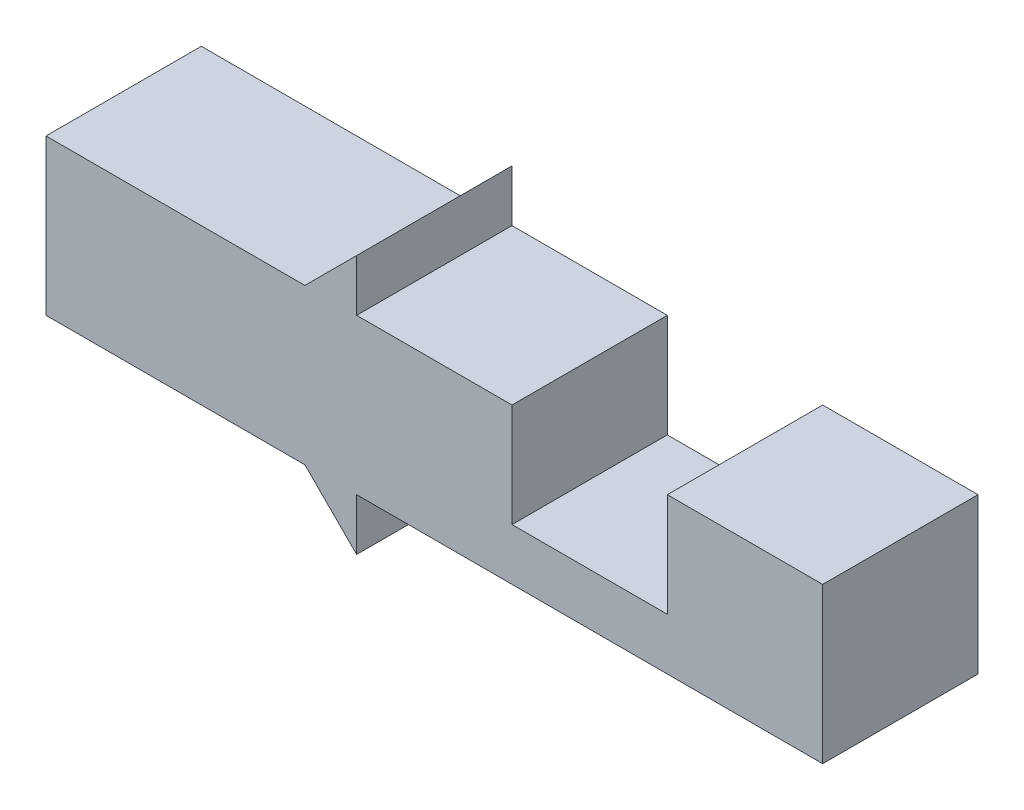
ISO-10303-21;
HEADER;
FILE_DESCRIPTION(('STEP AP214'),'2;1');
FILE_NAME('part.step','',(''),(''),'','','');
FILE_SCHEMA(('AUTOMOTIVE_DESIGN { 1 0 10303 214 1 1 1 1 }'));
ENDSEC;
DATA;
#1=APPLICATION_CONTEXT('core data for automotive mechanical design processes');
#2=APPLICATION_PROTOCOL_DEFINITION('international standard','automotive_design',2000,#1);
#3=PRODUCT_CONTEXT('',#1,'mechanical');
#4=PRODUCT('Part','Part','',(#3));
#5=PRODUCT_RELATED_PRODUCT_CATEGORY('part','',(#4));
#6=PRODUCT_DEFINITION_FORMATION('','',#4);
#7=PRODUCT_DEFINITION_CONTEXT('part definition',#1,'design');
#8=PRODUCT_DEFINITION('design','',#6,#7);
#9=PRODUCT_DEFINITION_SHAPE('','',#8);
#10=(LENGTH_UNIT() NAMED_UNIT(*) SI_UNIT(.MILLI.,.METRE.));
#11=(NAMED_UNIT(*) PLANE_ANGLE_UNIT() SI_UNIT($,.RADIAN.));
#12=(NAMED_UNIT(*) SI_UNIT($,.STERADIAN.) SOLID_ANGLE_UNIT());
#13=UNCERTAINTY_MEASURE_WITH_UNIT(LENGTH_MEASURE(1.E-05),#10,'distance_accuracy_value','');
#14=(GEOMETRIC_REPRESENTATION_CONTEXT(3) GLOBAL_UNCERTAINTY_ASSIGNED_CONTEXT((#13)) GLOBAL_UNIT_ASSIGNED_CONTEXT((#10,
#11,#12)) REPRESENTATION_CONTEXT('',''));
#15=CARTESIAN_POINT('',(0.,0.,0.));
#16=DIRECTION('',(0.,0.,1.));
#17=DIRECTION('',(1.,0.,0.));
#18=AXIS2_PLACEMENT_3D('',#15,#16,#17);
#19=CARTESIAN_POINT('',(0.,6.,6.));
#20=DIRECTION('',(-1.,0.,0.));
#21=DIRECTION('',(0.,-1.,0.));
#22=AXIS2_PLACEMENT_3D('',#19,#20,#21);
#23=PLANE('',#22);
#24=DIRECTION('',(0.,1.,0.));
#25=VECTOR('',#24,1.);
#26=CARTESIAN_POINT('',(0.,6.,0.));
#27=LINE('',#26,#25);
#28=CARTESIAN_POINT('',(0.,0.,0.));
#29=VERTEX_POINT('',#28);
#30=CARTESIAN_POINT('',(0.,6.,0.));
#31=VERTEX_POINT('',#30);
#32=EDGE_CURVE('E176',#29,#31,#27,.T.);
#33=ORIENTED_EDGE('',*,*,#32,.T.);
#34=DIRECTION('',(0.,0.,-1.));
#35=VECTOR('',#34,1.);
#36=CARTESIAN_POINT('',(0.,6.,6.));
#37=LINE('',#36,#35);
#38=CARTESIAN_POINT('',(0.,6.,6.));
#39=VERTEX_POINT('',#38);
#40=EDGE_CURVE('E11',#39,#31,#37,.T.);
#41=ORIENTED_EDGE('',*,*,#40,.F.);
#42=DIRECTION('',(0.,1.,0.));
#43=VECTOR('',#42,1.);
#44=CARTESIAN_POINT('',(0.,6.,6.));
#45=LINE('',#44,#43);
#46=CARTESIAN_POINT('',(0.,0.,6.));
#47=VERTEX_POINT('',#46);
#48=EDGE_CURVE('E216',#47,#39,#45,.T.);
#49=ORIENTED_EDGE('',*,*,#48,.F.);
#50=DIRECTION('',(0.,0.,-1.));
#51=VECTOR('',#50,1.);
#52=CARTESIAN_POINT('',(0.,0.,6.));
#53=LINE('',#52,#51);
#54=EDGE_CURVE('E172',#47,#29,#53,.T.);
#55=ORIENTED_EDGE('',*,*,#54,.T.);
#56=EDGE_LOOP('',(#33,#41,#49,#55));
#57=FACE_BOUND('',#56,.T.);
#58=ADVANCED_FACE('F39',(#57),#23,.F.);
#59=CARTESIAN_POINT('',(-6.,6.,6.));
#60=DIRECTION('',(0.,-1.,0.));
#61=DIRECTION('',(0.,0.,-1.));
#62=AXIS2_PLACEMENT_3D('',#59,#60,#61);
#63=PLANE('',#62);
#64=DIRECTION('',(-1.,0.,0.));
#65=VECTOR('',#64,1.);
#66=CARTESIAN_POINT('',(-6.,6.,0.));
#67=LINE('',#66,#65);
#68=CARTESIAN_POINT('',(-6.,6.,0.));
#69=VERTEX_POINT('',#68);
#70=EDGE_CURVE('E180',#31,#69,#67,.T.);
#71=ORIENTED_EDGE('',*,*,#70,.T.);
#72=DIRECTION('',(0.,0.,-1.));
#73=VECTOR('',#72,1.);
#74=CARTESIAN_POINT('',(-6.,6.,6.));
#75=LINE('',#74,#73);
#76=CARTESIAN_POINT('',(-6.,6.,6.));
#77=VERTEX_POINT('',#76);
#78=EDGE_CURVE('E48',#77,#69,#75,.T.);
#79=ORIENTED_EDGE('',*,*,#78,.F.);
#80=DIRECTION('',(-1.,0.,0.));
#81=VECTOR('',#80,1.);
#82=CARTESIAN_POINT('',(-6.,6.,6.));
#83=LINE('',#82,#81);
#84=EDGE_CURVE('E117',#39,#77,#83,.T.);
#85=ORIENTED_EDGE('',*,*,#84,.F.);
#86=ORIENTED_EDGE('',*,*,#40,.T.);
#87=EDGE_LOOP('',(#71,#79,#85,#86));
#88=FACE_BOUND('',#87,.T.);
#89=ADVANCED_FACE('F324',(#88),#63,.F.);
#90=CARTESIAN_POINT('',(-5.99999999999999,2.,6.));
#91=DIRECTION('',(1.,0.,0.));
#92=DIRECTION('',(0.,1.,0.));
#93=AXIS2_PLACEMENT_3D('',#90,#91,#92);
#94=PLANE('',#93);
#95=DIRECTION('',(0.,-1.,0.));
#96=VECTOR('',#95,1.);
#97=CARTESIAN_POINT('',(-5.99999999999999,2.,0.));
#98=LINE('',#97,#96);
#99=CARTESIAN_POINT('',(-5.99999999999999,2.,0.));
#100=VERTEX_POINT('',#99);
#101=EDGE_CURVE('E183',#69,#100,#98,.T.);
#102=ORIENTED_EDGE('',*,*,#101,.T.);
#103=DIRECTION('',(0.,0.,-1.));
#104=VECTOR('',#103,1.);
#105=CARTESIAN_POINT('',(-5.99999999999999,2.,6.));
#106=LINE('',#105,#104);
#107=CARTESIAN_POINT('',(-5.99999999999999,2.,6.));
#108=VERTEX_POINT('',#107);
#109=EDGE_CURVE('E251',#108,#100,#106,.T.);
#110=ORIENTED_EDGE('',*,*,#109,.F.);
#111=DIRECTION('',(0.,-1.,0.));
#112=VECTOR('',#111,1.);
#113=CARTESIAN_POINT('',(-5.99999999999999,2.,6.));
#114=LINE('',#113,#112);
#115=EDGE_CURVE('E261',#77,#108,#114,.T.);
#116=ORIENTED_EDGE('',*,*,#115,.F.);
#117=ORIENTED_EDGE('',*,*,#78,.T.);
#118=EDGE_LOOP('',(#102,#110,#116,#117));
#119=FACE_BOUND('',#118,.T.);
#120=ADVANCED_FACE('F259',(#119),#94,.F.);
#121=CARTESIAN_POINT('',(-12.,2.,6.));
#122=DIRECTION('',(0.,-1.,0.));
#123=DIRECTION('',(0.,0.,-1.));
#124=AXIS2_PLACEMENT_3D('',#121,#122,#123);
#125=PLANE('',#124);
#126=DIRECTION('',(-1.,0.,0.));
#127=VECTOR('',#126,1.);
#128=CARTESIAN_POINT('',(-12.,2.,0.));
#129=LINE('',#128,#127);
#130=CARTESIAN_POINT('',(-12.,2.,0.));
#131=VERTEX_POINT('',#130);
#132=EDGE_CURVE('E186',#100,#131,#129,.T.);
#133=ORIENTED_EDGE('',*,*,#132,.T.);
#134=DIRECTION('',(0.,0.,-1.));
#135=VECTOR('',#134,1.);
#136=CARTESIAN_POINT('',(-12.,2.,6.));
#137=LINE('',#136,#135);
#138=CARTESIAN_POINT('',(-12.,2.,6.));
#139=VERTEX_POINT('',#138);
#140=EDGE_CURVE('E247',#139,#131,#137,.T.);
#141=ORIENTED_EDGE('',*,*,#140,.F.);
#142=DIRECTION('',(-1.,0.,0.));
#143=VECTOR('',#142,1.);
#144=CARTESIAN_POINT('',(-12.,2.,6.));
#145=LINE('',#144,#143);
#146=EDGE_CURVE('E280',#108,#139,#145,.T.);
#147=ORIENTED_EDGE('',*,*,#146,.F.);
#148=ORIENTED_EDGE('',*,*,#109,.T.);
#149=EDGE_LOOP('',(#133,#141,#147,#148));
#150=FACE_BOUND('',#149,.T.);
#151=ADVANCED_FACE('F270',(#150),#125,.F.);
#152=CARTESIAN_POINT('',(-12.,6.,6.));
#153=DIRECTION('',(-1.,0.,0.));
#154=DIRECTION('',(0.,0.,1.));
#155=AXIS2_PLACEMENT_3D('',#152,#153,#154);
#156=PLANE('',#155);
#157=DIRECTION('',(0.,1.,0.));
#158=VECTOR('',#157,1.);
#159=CARTESIAN_POINT('',(-12.,6.,0.));
#160=LINE('',#159,#158);
#161=CARTESIAN_POINT('',(-12.,6.,0.));
#162=VERTEX_POINT('',#161);
#163=EDGE_CURVE('E189',#131,#162,#160,.T.);
#164=ORIENTED_EDGE('',*,*,#163,.T.);
#165=DIRECTION('',(0.,0.,-1.));
#166=VECTOR('',#165,1.);
#167=CARTESIAN_POINT('',(-12.,6.,6.));
#168=LINE('',#167,#166);
#169=CARTESIAN_POINT('',(-12.,6.,6.));
#170=VERTEX_POINT('',#169);
#171=EDGE_CURVE('E243',#170,#162,#168,.T.);
#172=ORIENTED_EDGE('',*,*,#171,.F.);
#173=DIRECTION('',(0.,1.,0.));
#174=VECTOR('',#173,1.);
#175=CARTESIAN_POINT('',(-12.,6.,6.));
#176=LINE('',#175,#174);
#177=EDGE_CURVE('E276',#139,#170,#176,.T.);
#178=ORIENTED_EDGE('',*,*,#177,.F.);
#179=ORIENTED_EDGE('',*,*,#140,.T.);
#180=EDGE_LOOP('',(#164,#172,#178,#179));
#181=FACE_BOUND('',#180,.T.);
#182=ADVANCED_FACE('F274',(#181),#156,.F.);
#183=CARTESIAN_POINT('',(-18.,6.,6.));
#184=DIRECTION('',(0.,-1.,0.));
#185=DIRECTION('',(1.,0.,0.));
#186=AXIS2_PLACEMENT_3D('',#183,#184,#185);
#187=PLANE('',#186);
#188=DIRECTION('',(-1.,0.,0.));
#189=VECTOR('',#188,1.);
#190=CARTESIAN_POINT('',(-18.,6.,0.));
#191=LINE('',#190,#189);
#192=CARTESIAN_POINT('',(-18.,6.,0.));
#193=VERTEX_POINT('',#192);
#194=EDGE_CURVE('E192',#162,#193,#191,.T.);
#195=ORIENTED_EDGE('',*,*,#194,.T.);
#196=DIRECTION('',(0.,0.,-1.));
#197=VECTOR('',#196,1.);
#198=CARTESIAN_POINT('',(-18.,6.,6.));
#199=LINE('',#198,#197);
#200=CARTESIAN_POINT('',(-18.,6.,6.));
#201=VERTEX_POINT('',#200);
#202=EDGE_CURVE('E239',#201,#193,#199,.T.);
#203=ORIENTED_EDGE('',*,*,#202,.F.);
#204=DIRECTION('',(-1.,0.,0.));
#205=VECTOR('',#204,1.);
#206=CARTESIAN_POINT('',(-18.,6.,6.));
#207=LINE('',#206,#205);
#208=EDGE_CURVE('E279',#170,#201,#207,.T.);
#209=ORIENTED_EDGE('',*,*,#208,.F.);
#210=ORIENTED_EDGE('',*,*,#171,.T.);
#211=EDGE_LOOP('',(#195,#203,#209,#210));
#212=FACE_BOUND('',#211,.T.);
#213=ADVANCED_FACE('F337',(#212),#187,.F.);
#214=CARTESIAN_POINT('',(-18.,8.,6.));
#215=DIRECTION('',(-1.,0.,0.));
#216=DIRECTION('',(0.,0.,1.));
#217=AXIS2_PLACEMENT_3D('',#214,#215,#216);
#218=PLANE('',#217);
#219=DIRECTION('',(0.,1.,0.));
#220=VECTOR('',#219,1.);
#221=CARTESIAN_POINT('',(-18.,8.,0.));
#222=LINE('',#221,#220);
#223=CARTESIAN_POINT('',(-18.,8.,0.));
#224=VERTEX_POINT('',#223);
#225=EDGE_CURVE('E195',#193,#224,#222,.T.);
#226=ORIENTED_EDGE('',*,*,#225,.T.);
#227=DIRECTION('',(0.,0.,-1.));
#228=VECTOR('',#227,1.);
#229=CARTESIAN_POINT('',(-18.,8.,6.));
#230=LINE('',#229,#228);
#231=CARTESIAN_POINT('',(-18.,8.,6.));
#232=VERTEX_POINT('',#231);
#233=EDGE_CURVE('E235',#232,#224,#230,.T.);
#234=ORIENTED_EDGE('',*,*,#233,.F.);
#235=DIRECTION('',(0.,1.,0.));
#236=VECTOR('',#235,1.);
#237=CARTESIAN_POINT('',(-18.,8.,6.));
#238=LINE('',#237,#236);
#239=EDGE_CURVE('E284',#201,#232,#238,.T.);
#240=ORIENTED_EDGE('',*,*,#239,.F.);
#241=ORIENTED_EDGE('',*,*,#202,.T.);
#242=EDGE_LOOP('',(#226,#234,#240,#241));
#243=FACE_BOUND('',#242,.T.);
#244=ADVANCED_FACE('F340',(#243),#218,.F.);
#245=CARTESIAN_POINT('',(-20.,6.,6.));
#246=DIRECTION('',(0.707106781186547,-0.707106781186548,0.));
#247=DIRECTION('',(0.707106781186548,0.707106781186547,0.));
#248=AXIS2_PLACEMENT_3D('',#245,#246,#247);
#249=PLANE('',#248);
#250=DIRECTION('',(-0.707106781186548,-0.707106781186547,0.));
#251=VECTOR('',#250,1.);
#252=CARTESIAN_POINT('',(-20.,6.,0.));
#253=LINE('',#252,#251);
#254=CARTESIAN_POINT('',(-20.,6.,0.));
#255=VERTEX_POINT('',#254);
#256=EDGE_CURVE('E198',#224,#255,#253,.T.);
#257=ORIENTED_EDGE('',*,*,#256,.T.);
#258=DIRECTION('',(0.,0.,-1.));
#259=VECTOR('',#258,1.);
#260=CARTESIAN_POINT('',(-20.,6.,6.));
#261=LINE('',#260,#259);
#262=CARTESIAN_POINT('',(-20.,6.,6.));
#263=VERTEX_POINT('',#262);
#264=EDGE_CURVE('E231',#263,#255,#261,.T.);
#265=ORIENTED_EDGE('',*,*,#264,.F.);
#266=DIRECTION('',(-0.707106781186548,-0.707106781186547,0.));
#267=VECTOR('',#266,1.);
#268=CARTESIAN_POINT('',(-20.,6.,6.));
#269=LINE('',#268,#267);
#270=EDGE_CURVE('E291',#232,#263,#269,.T.);
#271=ORIENTED_EDGE('',*,*,#270,.F.);
#272=ORIENTED_EDGE('',*,*,#233,.T.);
#273=EDGE_LOOP('',(#257,#265,#271,#272));
#274=FACE_BOUND('',#273,.T.);
#275=ADVANCED_FACE('F344',(#274),#249,.F.);
#276=CARTESIAN_POINT('',(-30.,6.,6.));
#277=DIRECTION('',(0.,-1.,0.));
#278=DIRECTION('',(1.,0.,0.));
#279=AXIS2_PLACEMENT_3D('',#276,#277,#278);
#280=PLANE('',#279);
#281=DIRECTION('',(-1.,0.,0.));
#282=VECTOR('',#281,1.);
#283=CARTESIAN_POINT('',(-30.,6.,0.));
#284=LINE('',#283,#282);
#285=CARTESIAN_POINT('',(-30.,6.,0.));
#286=VERTEX_POINT('',#285);
#287=EDGE_CURVE('E201',#255,#286,#284,.T.);
#288=ORIENTED_EDGE('',*,*,#287,.T.);
#289=DIRECTION('',(0.,0.,-1.));
#290=VECTOR('',#289,1.);
#291=CARTESIAN_POINT('',(-30.,6.,6.));
#292=LINE('',#291,#290);
#293=CARTESIAN_POINT('',(-30.,6.,6.));
#294=VERTEX_POINT('',#293);
#295=EDGE_CURVE('E227',#294,#286,#292,.T.);
#296=ORIENTED_EDGE('',*,*,#295,.F.);
#297=DIRECTION('',(-1.,0.,0.));
#298=VECTOR('',#297,1.);
#299=CARTESIAN_POINT('',(-30.,6.,6.));
#300=LINE('',#299,#298);
#301=EDGE_CURVE('E294',#263,#294,#300,.T.);
#302=ORIENTED_EDGE('',*,*,#301,.F.);
#303=ORIENTED_EDGE('',*,*,#264,.T.);
#304=EDGE_LOOP('',(#288,#296,#302,#303));
#305=FACE_BOUND('',#304,.T.);
#306=ADVANCED_FACE('F348',(#305),#280,.F.);
#307=CARTESIAN_POINT('',(-30.,0.,6.));
#308=DIRECTION('',(1.,0.,0.));
#309=DIRECTION('',(0.,0.,-1.));
#310=AXIS2_PLACEMENT_3D('',#307,#308,#309);
#311=PLANE('',#310);
#312=DIRECTION('',(0.,-1.,0.));
#313=VECTOR('',#312,1.);
#314=CARTESIAN_POINT('',(-30.,0.,0.));
#315=LINE('',#314,#313);
#316=CARTESIAN_POINT('',(-30.,0.,0.));
#317=VERTEX_POINT('',#316);
#318=EDGE_CURVE('E204',#286,#317,#315,.T.);
#319=ORIENTED_EDGE('',*,*,#318,.T.);
#320=DIRECTION('',(0.,0.,-1.));
#321=VECTOR('',#320,1.);
#322=CARTESIAN_POINT('',(-30.,0.,6.));
#323=LINE('',#322,#321);
#324=CARTESIAN_POINT('',(-30.,0.,6.));
#325=VERTEX_POINT('',#324);
#326=EDGE_CURVE('E223',#325,#317,#323,.T.);
#327=ORIENTED_EDGE('',*,*,#326,.F.);
#328=DIRECTION('',(0.,-1.,0.));
#329=VECTOR('',#328,1.);
#330=CARTESIAN_POINT('',(-30.,0.,6.));
#331=LINE('',#330,#329);
#332=EDGE_CURVE('E297',#294,#325,#331,.T.);
#333=ORIENTED_EDGE('',*,*,#332,.F.);
#334=ORIENTED_EDGE('',*,*,#295,.T.);
#335=EDGE_LOOP('',(#319,#327,#333,#334));
#336=FACE_BOUND('',#335,.T.);
#337=ADVANCED_FACE('F305',(#336),#311,.F.);
#338=CARTESIAN_POINT('',(-20.,0.,6.));
#339=DIRECTION('',(0.,1.,0.));
#340=DIRECTION('',(-1.,0.,0.));
#341=AXIS2_PLACEMENT_3D('',#338,#339,#340);
#342=PLANE('',#341);
#343=DIRECTION('',(1.,0.,0.));
#344=VECTOR('',#343,1.);
#345=CARTESIAN_POINT('',(-20.,0.,0.));
#346=LINE('',#345,#344);
#347=CARTESIAN_POINT('',(-20.,0.,0.));
#348=VERTEX_POINT('',#347);
#349=EDGE_CURVE('E207',#317,#348,#346,.T.);
#350=ORIENTED_EDGE('',*,*,#349,.T.);
#351=DIRECTION('',(0.,0.,-1.));
#352=VECTOR('',#351,1.);
#353=CARTESIAN_POINT('',(-20.,0.,6.));
#354=LINE('',#353,#352);
#355=CARTESIAN_POINT('',(-20.,0.,6.));
#356=VERTEX_POINT('',#355);
#357=EDGE_CURVE('E165',#356,#348,#354,.T.);
#358=ORIENTED_EDGE('',*,*,#357,.F.);
#359=DIRECTION('',(1.,0.,0.));
#360=VECTOR('',#359,1.);
#361=CARTESIAN_POINT('',(-20.,0.,6.));
#362=LINE('',#361,#360);
#363=EDGE_CURVE('E154',#325,#356,#362,.T.);
#364=ORIENTED_EDGE('',*,*,#363,.F.);
#365=ORIENTED_EDGE('',*,*,#326,.T.);
#366=EDGE_LOOP('',(#350,#358,#364,#365));
#367=FACE_BOUND('',#366,.T.);
#368=ADVANCED_FACE('F309',(#367),#342,.F.);
#369=CARTESIAN_POINT('',(-18.,-2.,6.));
#370=DIRECTION('',(0.707106781186548,0.707106781186547,0.));
#371=DIRECTION('',(-0.707106781186547,0.707106781186548,0.));
#372=AXIS2_PLACEMENT_3D('',#369,#370,#371);
#373=PLANE('',#372);
#374=DIRECTION('',(0.707106781186547,-0.707106781186548,0.));
#375=VECTOR('',#374,1.);
#376=CARTESIAN_POINT('',(-18.,-2.,0.));
#377=LINE('',#376,#375);
#378=CARTESIAN_POINT('',(-18.,-2.,0.));
#379=VERTEX_POINT('',#378);
#380=EDGE_CURVE('E163',#348,#379,#377,.T.);
#381=ORIENTED_EDGE('',*,*,#380,.T.);
#382=DIRECTION('',(0.,0.,-1.));
#383=VECTOR('',#382,1.);
#384=CARTESIAN_POINT('',(-18.,-2.,6.));
#385=LINE('',#384,#383);
#386=CARTESIAN_POINT('',(-18.,-2.,6.));
#387=VERTEX_POINT('',#386);
#388=EDGE_CURVE('E160',#387,#379,#385,.T.);
#389=ORIENTED_EDGE('',*,*,#388,.F.);
#390=DIRECTION('',(0.707106781186547,-0.707106781186548,0.));
#391=VECTOR('',#390,1.);
#392=CARTESIAN_POINT('',(-18.,-2.,6.));
#393=LINE('',#392,#391);
#394=EDGE_CURVE('E148',#356,#387,#393,.T.);
#395=ORIENTED_EDGE('',*,*,#394,.F.);
#396=ORIENTED_EDGE('',*,*,#357,.T.);
#397=EDGE_LOOP('',(#381,#389,#395,#396));
#398=FACE_BOUND('',#397,.T.);
#399=ADVANCED_FACE('F161',(#398),#373,.F.);
#400=CARTESIAN_POINT('',(-18.,0.,6.));
#401=DIRECTION('',(-1.,0.,0.));
#402=DIRECTION('',(0.,0.,1.));
#403=AXIS2_PLACEMENT_3D('',#400,#401,#402);
#404=PLANE('',#403);
#405=DIRECTION('',(0.,1.,0.));
#406=VECTOR('',#405,1.);
#407=CARTESIAN_POINT('',(-18.,0.,0.));
#408=LINE('',#407,#406);
#409=CARTESIAN_POINT('',(-18.,0.,0.));
#410=VERTEX_POINT('',#409);
#411=EDGE_CURVE('E103',#379,#410,#408,.T.);
#412=ORIENTED_EDGE('',*,*,#411,.T.);
#413=DIRECTION('',(0.,0.,-1.));
#414=VECTOR('',#413,1.);
#415=CARTESIAN_POINT('',(-18.,0.,6.));
#416=LINE('',#415,#414);
#417=CARTESIAN_POINT('',(-18.,0.,6.));
#418=VERTEX_POINT('',#417);
#419=EDGE_CURVE('E166',#418,#410,#416,.T.);
#420=ORIENTED_EDGE('',*,*,#419,.F.);
#421=DIRECTION('',(0.,1.,0.));
#422=VECTOR('',#421,1.);
#423=CARTESIAN_POINT('',(-18.,0.,6.));
#424=LINE('',#423,#422);
#425=EDGE_CURVE('E152',#387,#418,#424,.T.);
#426=ORIENTED_EDGE('',*,*,#425,.F.);
#427=ORIENTED_EDGE('',*,*,#388,.T.);
#428=EDGE_LOOP('',(#412,#420,#426,#427));
#429=FACE_BOUND('',#428,.T.);
#430=ADVANCED_FACE('F168',(#429),#404,.F.);
#431=CARTESIAN_POINT('',(0.,0.,6.));
#432=DIRECTION('',(0.,1.,0.));
#433=DIRECTION('',(-1.,0.,0.));
#434=AXIS2_PLACEMENT_3D('',#431,#432,#433);
#435=PLANE('',#434);
#436=DIRECTION('',(1.,0.,0.));
#437=VECTOR('',#436,1.);
#438=CARTESIAN_POINT('',(0.,0.,0.));
#439=LINE('',#438,#437);
#440=EDGE_CURVE('E109',#410,#29,#439,.T.);
#441=ORIENTED_EDGE('',*,*,#440,.T.);
#442=ORIENTED_EDGE('',*,*,#54,.F.);
#443=DIRECTION('',(1.,0.,0.));
#444=VECTOR('',#443,1.);
#445=CARTESIAN_POINT('',(0.,0.,6.));
#446=LINE('',#445,#444);
#447=EDGE_CURVE('E56',#418,#47,#446,.T.);
#448=ORIENTED_EDGE('',*,*,#447,.F.);
#449=ORIENTED_EDGE('',*,*,#419,.T.);
#450=EDGE_LOOP('',(#441,#442,#448,#449));
#451=FACE_BOUND('',#450,.T.);
#452=ADVANCED_FACE('F313',(#451),#435,.F.);
#453=CARTESIAN_POINT('',(0.,0.,6.));
#454=DIRECTION('',(0.,0.,-1.));
#455=DIRECTION('',(-1.,0.,0.));
#456=AXIS2_PLACEMENT_3D('',#453,#454,#455);
#457=PLANE('',#456);
#458=ORIENTED_EDGE('',*,*,#48,.T.);
#459=ORIENTED_EDGE('',*,*,#84,.T.);
#460=ORIENTED_EDGE('',*,*,#115,.T.);
#461=ORIENTED_EDGE('',*,*,#146,.T.);
#462=ORIENTED_EDGE('',*,*,#177,.T.);
#463=ORIENTED_EDGE('',*,*,#208,.T.);
#464=ORIENTED_EDGE('',*,*,#239,.T.);
#465=ORIENTED_EDGE('',*,*,#270,.T.);
#466=ORIENTED_EDGE('',*,*,#301,.T.);
#467=ORIENTED_EDGE('',*,*,#332,.T.);
#468=ORIENTED_EDGE('',*,*,#363,.T.);
#469=ORIENTED_EDGE('',*,*,#394,.T.);
#470=ORIENTED_EDGE('',*,*,#425,.T.);
#471=ORIENTED_EDGE('',*,*,#447,.T.);
#472=EDGE_LOOP('',(#458,#459,#460,#461,#462,#463,#464,#465,#466,#467,#468,#469,#470,#471));
#473=FACE_BOUND('',#472,.T.);
#474=ADVANCED_FACE('F150',(#473),#457,.F.);
#475=CARTESIAN_POINT('',(0.,0.,0.));
#476=DIRECTION('',(0.,0.,-1.));
#477=DIRECTION('',(-1.,0.,0.));
#478=AXIS2_PLACEMENT_3D('',#475,#476,#477);
#479=PLANE('',#478);
#480=ORIENTED_EDGE('',*,*,#32,.F.);
#481=ORIENTED_EDGE('',*,*,#440,.F.);
#482=ORIENTED_EDGE('',*,*,#411,.F.);
#483=ORIENTED_EDGE('',*,*,#380,.F.);
#484=ORIENTED_EDGE('',*,*,#349,.F.);
#485=ORIENTED_EDGE('',*,*,#318,.F.);
#486=ORIENTED_EDGE('',*,*,#287,.F.);
#487=ORIENTED_EDGE('',*,*,#256,.F.);
#488=ORIENTED_EDGE('',*,*,#225,.F.);
#489=ORIENTED_EDGE('',*,*,#194,.F.);
#490=ORIENTED_EDGE('',*,*,#163,.F.);
#491=ORIENTED_EDGE('',*,*,#132,.F.);
#492=ORIENTED_EDGE('',*,*,#101,.F.);
#493=ORIENTED_EDGE('',*,*,#70,.F.);
#494=EDGE_LOOP('',(#480,#481,#482,#483,#484,#485,#486,#487,#488,#489,#490,#491,#492,#493));
#495=FACE_BOUND('',#494,.T.);
#496=ADVANCED_FACE('F265',(#495),#479,.T.);
#497=CLOSED_SHELL('',(#58,#89,#120,#151,#182,#213,#244,#275,#306,#337,#368,#399,#430,#452,#474,#496));
#498=MANIFOLD_SOLID_BREP('B2',#497);
#499=ADVANCED_BREP_SHAPE_REPRESENTATION('',(#18,#498),#14);
#500=SHAPE_DEFINITION_REPRESENTATION(#9,#499);
ENDSEC;
END-ISO-10303-21;
